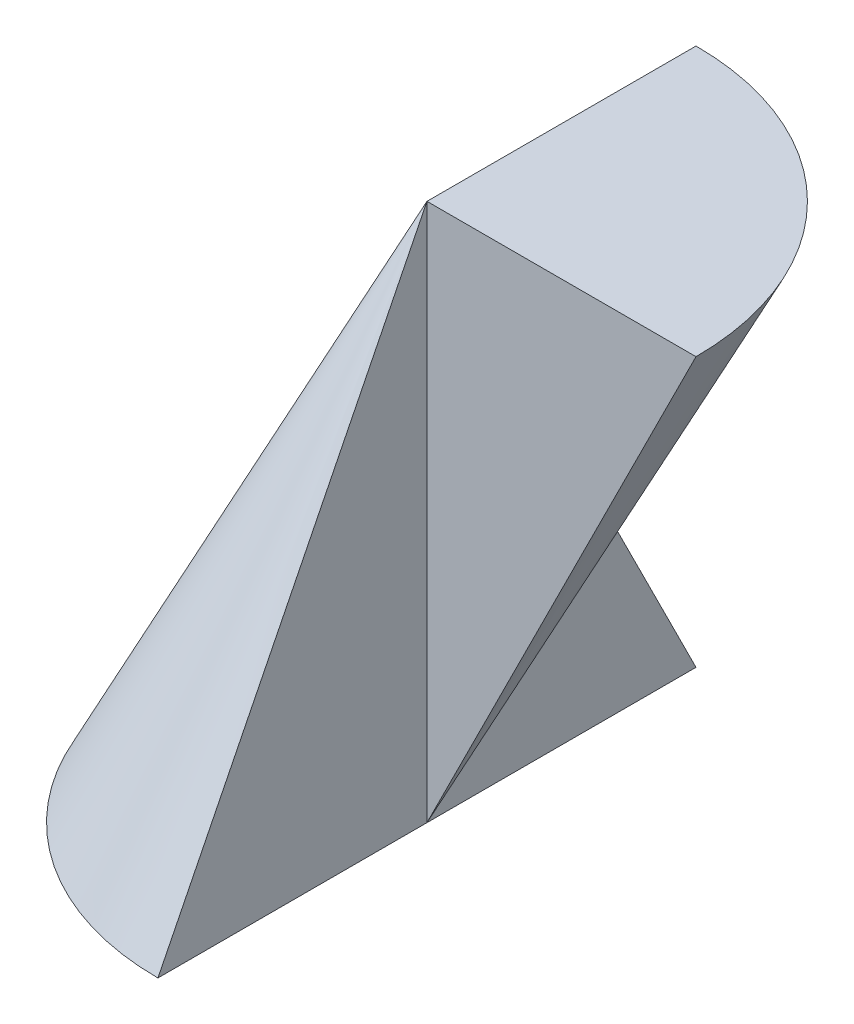
ISO-10303-21;
HEADER;
FILE_DESCRIPTION(('STEP AP214'),'2;1');
FILE_NAME('part.step','',(''),(''),'','','');
FILE_SCHEMA(('AUTOMOTIVE_DESIGN { 1 0 10303 214 1 1 1 1 }'));
ENDSEC;
DATA;
#1=APPLICATION_CONTEXT('core data for automotive mechanical design processes');
#2=APPLICATION_PROTOCOL_DEFINITION('international standard','automotive_design',2000,#1);
#3=PRODUCT_CONTEXT('',#1,'mechanical');
#4=PRODUCT('Part','Part','',(#3));
#5=PRODUCT_RELATED_PRODUCT_CATEGORY('part','',(#4));
#6=PRODUCT_DEFINITION_FORMATION('','',#4);
#7=PRODUCT_DEFINITION_CONTEXT('part definition',#1,'design');
#8=PRODUCT_DEFINITION('design','',#6,#7);
#9=PRODUCT_DEFINITION_SHAPE('','',#8);
#10=(LENGTH_UNIT() NAMED_UNIT(*) SI_UNIT(.MILLI.,.METRE.));
#11=(NAMED_UNIT(*) PLANE_ANGLE_UNIT() SI_UNIT($,.RADIAN.));
#12=(NAMED_UNIT(*) SI_UNIT($,.STERADIAN.) SOLID_ANGLE_UNIT());
#13=UNCERTAINTY_MEASURE_WITH_UNIT(LENGTH_MEASURE(1.E-05),#10,'distance_accuracy_value','');
#14=(GEOMETRIC_REPRESENTATION_CONTEXT(3) GLOBAL_UNCERTAINTY_ASSIGNED_CONTEXT((#13)) GLOBAL_UNIT_ASSIGNED_CONTEXT((#10,
#11,#12)) REPRESENTATION_CONTEXT('',''));
#15=CARTESIAN_POINT('',(0.,0.,0.));
#16=DIRECTION('',(0.,0.,1.));
#17=DIRECTION('',(1.,0.,0.));
#18=AXIS2_PLACEMENT_3D('',#15,#16,#17);
#19=CARTESIAN_POINT('',(0.,0.,0.));
#20=DIRECTION('',(-1.,0.,0.));
#21=DIRECTION('',(0.,0.,1.));
#22=AXIS2_PLACEMENT_3D('',#19,#20,#21);
#23=PLANE('',#22);
#24=DIRECTION('',(0.,0.894427190999916,-0.447213595499958));
#25=VECTOR('',#24,1.);
#26=CARTESIAN_POINT('',(0.,0.,0.));
#27=LINE('',#26,#25);
#28=CARTESIAN_POINT('',(0.,0.,0.));
#29=VERTEX_POINT('',#28);
#30=CARTESIAN_POINT('',(0.,2.,-1.));
#31=VERTEX_POINT('',#30);
#32=EDGE_CURVE('E81',#29,#31,#27,.T.);
#33=ORIENTED_EDGE('',*,*,#32,.F.);
#34=DIRECTION('',(0.,0.,1.));
#35=VECTOR('',#34,1.);
#36=CARTESIAN_POINT('',(0.,0.,0.));
#37=LINE('',#36,#35);
#38=CARTESIAN_POINT('',(0.,0.,-2.));
#39=VERTEX_POINT('',#38);
#40=EDGE_CURVE('E103',#39,#29,#37,.T.);
#41=ORIENTED_EDGE('',*,*,#40,.F.);
#42=DIRECTION('',(0.,0.894427190999916,0.447213595499958));
#43=VECTOR('',#42,1.);
#44=CARTESIAN_POINT('',(0.,0.,-2.));
#45=LINE('',#44,#43);
#46=EDGE_CURVE('E100',#39,#31,#45,.T.);
#47=ORIENTED_EDGE('',*,*,#46,.T.);
#48=EDGE_LOOP('',(#33,#41,#47));
#49=FACE_BOUND('',#48,.T.);
#50=ADVANCED_FACE('F33',(#49),#23,.F.);
#51=DIRECTION('',(0.,-1.,0.));
#52=VECTOR('',#51,1.);
#53=CARTESIAN_POINT('',(0.,4.,0.));
#54=LINE('',#53,#52);
#55=CARTESIAN_POINT('',(0.,4.,0.));
#56=VERTEX_POINT('',#55);
#57=EDGE_CURVE('E56',#56,#29,#54,.T.);
#58=ORIENTED_EDGE('',*,*,#57,.F.);
#59=DIRECTION('',(0.,0.894427190999916,-0.447213595499958));
#60=VECTOR('',#59,1.);
#61=CARTESIAN_POINT('',(0.,0.,2.));
#62=LINE('',#61,#60);
#63=CARTESIAN_POINT('',(0.,0.,2.));
#64=VERTEX_POINT('',#63);
#65=EDGE_CURVE('E41',#64,#56,#62,.T.);
#66=ORIENTED_EDGE('',*,*,#65,.F.);
#67=EDGE_CURVE('E102',#29,#64,#37,.T.);
#68=ORIENTED_EDGE('',*,*,#67,.F.);
#69=EDGE_LOOP('',(#58,#66,#68));
#70=FACE_BOUND('',#69,.T.);
#71=ADVANCED_FACE('F106',(#70),#23,.F.);
#72=CARTESIAN_POINT('',(0.,0.,0.));
#73=DIRECTION('',(0.,-1.,0.));
#74=DIRECTION('',(0.,0.,-1.));
#75=AXIS2_PLACEMENT_3D('',#72,#73,#74);
#76=PLANE('',#75);
#77=CARTESIAN_POINT('',(0.,0.,0.));
#78=DIRECTION('',(0.,-1.,0.));
#79=DIRECTION('',(0.,0.,-1.));
#80=AXIS2_PLACEMENT_3D('',#77,#78,#79);
#81=CIRCLE('',#80,2.);
#82=EDGE_CURVE('E11',#64,#39,#81,.T.);
#83=ORIENTED_EDGE('',*,*,#82,.T.);
#84=ORIENTED_EDGE('',*,*,#40,.T.);
#85=ORIENTED_EDGE('',*,*,#67,.T.);
#86=EDGE_LOOP('',(#83,#84,#85));
#87=FACE_BOUND('',#86,.T.);
#88=ADVANCED_FACE('F35',(#87),#76,.T.);
#89=CARTESIAN_POINT('',(0.,0.,0.));
#90=DIRECTION('',(0.,-1.,0.));
#91=DIRECTION('',(0.,0.,-1.));
#92=AXIS2_PLACEMENT_3D('',#89,#90,#91);
#93=CONICAL_SURFACE('',#92,2.,0.463647609000806);
#94=ORIENTED_EDGE('',*,*,#65,.T.);
#95=EDGE_CURVE('E48',#31,#56,#45,.T.);
#96=ORIENTED_EDGE('',*,*,#95,.F.);
#97=ORIENTED_EDGE('',*,*,#46,.F.);
#98=ORIENTED_EDGE('',*,*,#82,.F.);
#99=EDGE_LOOP('',(#94,#96,#97,#98));
#100=FACE_BOUND('',#99,.T.);
#101=ADVANCED_FACE('F105',(#100),#93,.T.);
#102=CARTESIAN_POINT('',(2.,4.,0.));
#103=DIRECTION('',(0.,-1.,0.));
#104=DIRECTION('',(0.,0.,-1.));
#105=AXIS2_PLACEMENT_3D('',#102,#103,#104);
#106=PLANE('',#105);
#107=CARTESIAN_POINT('',(0.,4.,0.));
#108=DIRECTION('',(0.,1.,0.));
#109=DIRECTION('',(0.,0.,1.));
#110=AXIS2_PLACEMENT_3D('',#107,#108,#109);
#111=CIRCLE('',#110,2.);
#112=CARTESIAN_POINT('',(2.,4.,0.));
#113=VERTEX_POINT('',#112);
#114=CARTESIAN_POINT('',(0.,4.,-2.));
#115=VERTEX_POINT('',#114);
#116=EDGE_CURVE('E78',#113,#115,#111,.T.);
#117=ORIENTED_EDGE('',*,*,#116,.T.);
#118=DIRECTION('',(0.,0.,1.));
#119=VECTOR('',#118,1.);
#120=CARTESIAN_POINT('',(0.,4.,-2.));
#121=LINE('',#120,#119);
#122=EDGE_CURVE('E89',#115,#56,#121,.T.);
#123=ORIENTED_EDGE('',*,*,#122,.T.);
#124=DIRECTION('',(-1.,0.,0.));
#125=VECTOR('',#124,1.);
#126=CARTESIAN_POINT('',(2.,4.,0.));
#127=LINE('',#126,#125);
#128=EDGE_CURVE('E91',#113,#56,#127,.T.);
#129=ORIENTED_EDGE('',*,*,#128,.F.);
#130=EDGE_LOOP('',(#117,#123,#129));
#131=FACE_BOUND('',#130,.T.);
#132=ADVANCED_FACE('F88',(#131),#106,.F.);
#133=CARTESIAN_POINT('',(0.,0.,0.));
#134=DIRECTION('',(0.,1.,0.));
#135=DIRECTION('',(0.,0.,1.));
#136=AXIS2_PLACEMENT_3D('',#133,#134,#135);
#137=CONICAL_SURFACE('',#136,0.,0.463647609000806);
#138=DIRECTION('',(0.447213595499958,0.894427190999916,0.));
#139=VECTOR('',#138,1.);
#140=CARTESIAN_POINT('',(0.,0.,0.));
#141=LINE('',#140,#139);
#142=EDGE_CURVE('E95',#29,#113,#141,.T.);
#143=ORIENTED_EDGE('',*,*,#142,.F.);
#144=ORIENTED_EDGE('',*,*,#32,.T.);
#145=EDGE_CURVE('E74',#31,#115,#27,.T.);
#146=ORIENTED_EDGE('',*,*,#145,.T.);
#147=ORIENTED_EDGE('',*,*,#116,.F.);
#148=EDGE_LOOP('',(#143,#144,#146,#147));
#149=FACE_BOUND('',#148,.T.);
#150=ADVANCED_FACE('F77',(#149),#137,.T.);
#151=CARTESIAN_POINT('',(0.,0.,0.));
#152=DIRECTION('',(0.,0.,-1.));
#153=DIRECTION('',(-1.,0.,0.));
#154=AXIS2_PLACEMENT_3D('',#151,#152,#153);
#155=PLANE('',#154);
#156=ORIENTED_EDGE('',*,*,#57,.T.);
#157=ORIENTED_EDGE('',*,*,#142,.T.);
#158=ORIENTED_EDGE('',*,*,#128,.T.);
#159=EDGE_LOOP('',(#156,#157,#158));
#160=FACE_BOUND('',#159,.T.);
#161=ADVANCED_FACE('F110',(#160),#155,.F.);
#162=CARTESIAN_POINT('',(0.,0.,0.));
#163=DIRECTION('',(-1.,0.,0.));
#164=DIRECTION('',(0.,0.,1.));
#165=AXIS2_PLACEMENT_3D('',#162,#163,#164);
#166=PLANE('',#165);
#167=ORIENTED_EDGE('',*,*,#145,.F.);
#168=ORIENTED_EDGE('',*,*,#95,.T.);
#169=ORIENTED_EDGE('',*,*,#122,.F.);
#170=EDGE_LOOP('',(#167,#168,#169));
#171=FACE_BOUND('',#170,.T.);
#172=ADVANCED_FACE('F93',(#171),#166,.T.);
#173=CLOSED_SHELL('',(#50,#71,#88,#101,#132,#150,#161,#172));
#174=MANIFOLD_SOLID_BREP('B2',#173);
#175=ADVANCED_BREP_SHAPE_REPRESENTATION('',(#18,#174),#14);
#176=SHAPE_DEFINITION_REPRESENTATION(#9,#175);
ENDSEC;
END-ISO-10303-21;
